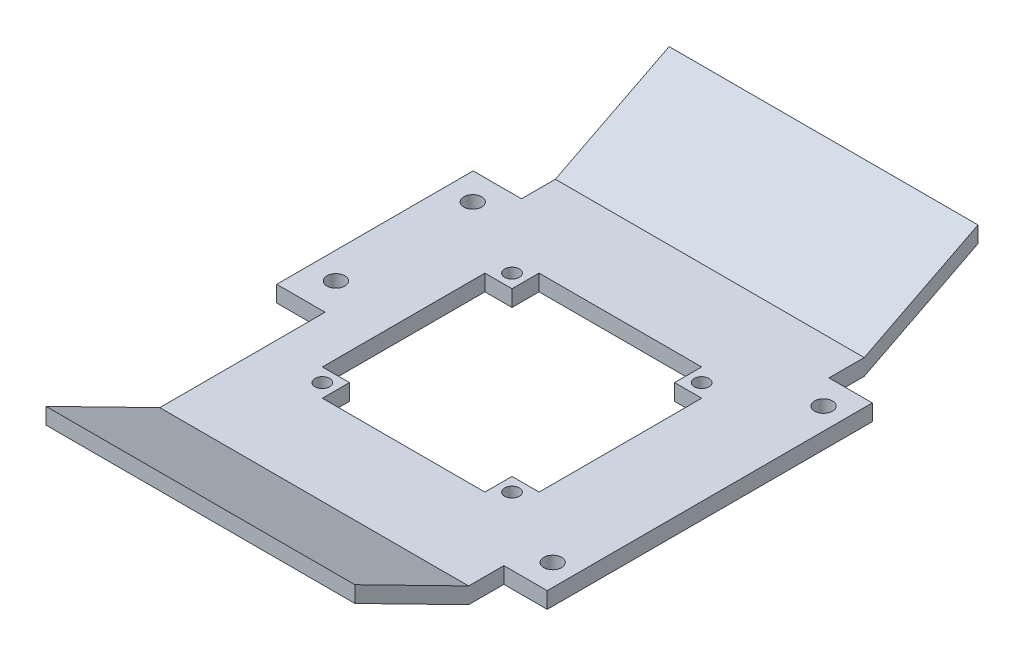
ISO-10303-21;
HEADER;
FILE_DESCRIPTION(('STEP AP214'),'2;1');
FILE_NAME('part.step','',(''),(''),'','','');
FILE_SCHEMA(('AUTOMOTIVE_DESIGN { 1 0 10303 214 1 1 1 1 }'));
ENDSEC;
DATA;
#1=APPLICATION_CONTEXT('core data for automotive mechanical design processes');
#2=APPLICATION_PROTOCOL_DEFINITION('international standard','automotive_design',2000,#1);
#3=PRODUCT_CONTEXT('',#1,'mechanical');
#4=PRODUCT('Part','Part','',(#3));
#5=PRODUCT_RELATED_PRODUCT_CATEGORY('part','',(#4));
#6=PRODUCT_DEFINITION_FORMATION('','',#4);
#7=PRODUCT_DEFINITION_CONTEXT('part definition',#1,'design');
#8=PRODUCT_DEFINITION('design','',#6,#7);
#9=PRODUCT_DEFINITION_SHAPE('','',#8);
#10=(LENGTH_UNIT() NAMED_UNIT(*) SI_UNIT(.MILLI.,.METRE.));
#11=(NAMED_UNIT(*) PLANE_ANGLE_UNIT() SI_UNIT($,.RADIAN.));
#12=(NAMED_UNIT(*) SI_UNIT($,.STERADIAN.) SOLID_ANGLE_UNIT());
#13=UNCERTAINTY_MEASURE_WITH_UNIT(LENGTH_MEASURE(1.E-05),#10,'distance_accuracy_value','');
#14=(GEOMETRIC_REPRESENTATION_CONTEXT(3) GLOBAL_UNCERTAINTY_ASSIGNED_CONTEXT((#13)) GLOBAL_UNIT_ASSIGNED_CONTEXT((#10,
#11,#12)) REPRESENTATION_CONTEXT('',''));
#15=CARTESIAN_POINT('',(0.,0.,0.));
#16=DIRECTION('',(0.,0.,1.));
#17=DIRECTION('',(1.,0.,0.));
#18=AXIS2_PLACEMENT_3D('',#15,#16,#17);
#19=CARTESIAN_POINT('',(28.5,0.,0.));
#20=DIRECTION('',(1.,0.,0.));
#21=DIRECTION('',(0.,0.,-1.));
#22=AXIS2_PLACEMENT_3D('',#19,#20,#21);
#23=PLANE('',#22);
#24=DIRECTION('',(0.,0.,1.));
#25=VECTOR('',#24,1.);
#26=CARTESIAN_POINT('',(28.5,2.99999999999999,-36.5));
#27=LINE('',#26,#25);
#28=CARTESIAN_POINT('',(28.5,2.99999999999999,-36.5));
#29=VERTEX_POINT('',#28);
#30=CARTESIAN_POINT('',(28.5,3.,-30.));
#31=VERTEX_POINT('',#30);
#32=EDGE_CURVE('E255',#29,#31,#27,.T.);
#33=ORIENTED_EDGE('',*,*,#32,.T.);
#34=DIRECTION('',(0.,-1.,0.));
#35=VECTOR('',#34,1.);
#36=CARTESIAN_POINT('',(28.5,3.,-30.));
#37=LINE('',#36,#35);
#38=CARTESIAN_POINT('',(28.5,0.,-30.));
#39=VERTEX_POINT('',#38);
#40=EDGE_CURVE('E378',#31,#39,#37,.T.);
#41=ORIENTED_EDGE('',*,*,#40,.T.);
#42=DIRECTION('',(0.,0.,-1.));
#43=VECTOR('',#42,1.);
#44=CARTESIAN_POINT('',(28.5,0.,36.5));
#45=LINE('',#44,#43);
#46=CARTESIAN_POINT('',(28.5,0.,-36.5));
#47=VERTEX_POINT('',#46);
#48=EDGE_CURVE('E491',#39,#47,#45,.T.);
#49=ORIENTED_EDGE('',*,*,#48,.T.);
#50=DIRECTION('',(0.,0.453990499739541,-0.891006524188371));
#51=VECTOR('',#50,1.);
#52=CARTESIAN_POINT('',(28.5,10.7000344393829,-57.5));
#53=LINE('',#52,#51);
#54=CARTESIAN_POINT('',(28.5,10.7000344393829,-57.5));
#55=VERTEX_POINT('',#54);
#56=EDGE_CURVE('E493',#47,#55,#53,.T.);
#57=ORIENTED_EDGE('',*,*,#56,.T.);
#58=DIRECTION('',(0.,1.,0.));
#59=VECTOR('',#58,1.);
#60=CARTESIAN_POINT('',(28.5,13.7000344393829,-57.5));
#61=LINE('',#60,#59);
#62=CARTESIAN_POINT('',(28.5,13.7000344393829,-57.5));
#63=VERTEX_POINT('',#62);
#64=EDGE_CURVE('E260',#55,#63,#61,.T.);
#65=ORIENTED_EDGE('',*,*,#64,.T.);
#66=DIRECTION('',(0.,-0.453990499739542,0.89100652418837));
#67=VECTOR('',#66,1.);
#68=CARTESIAN_POINT('',(28.5,2.99999999999999,-36.5));
#69=LINE('',#68,#67);
#70=EDGE_CURVE('E256',#63,#29,#69,.T.);
#71=ORIENTED_EDGE('',*,*,#70,.T.);
#72=EDGE_LOOP('',(#33,#41,#49,#57,#65,#71));
#73=FACE_BOUND('',#72,.T.);
#74=ADVANCED_FACE('F39',(#73),#23,.T.);
#75=CARTESIAN_POINT('',(-28.5,0.,0.));
#76=DIRECTION('',(1.,0.,0.));
#77=DIRECTION('',(0.,0.,-1.));
#78=AXIS2_PLACEMENT_3D('',#75,#76,#77);
#79=PLANE('',#78);
#80=DIRECTION('',(0.,-1.,0.));
#81=VECTOR('',#80,1.);
#82=CARTESIAN_POINT('',(-28.5,3.,-30.2513876574721));
#83=LINE('',#82,#81);
#84=CARTESIAN_POINT('',(-28.5,3.,-30.2513876574721));
#85=VERTEX_POINT('',#84);
#86=CARTESIAN_POINT('',(-28.5,0.,-30.2513876574721));
#87=VERTEX_POINT('',#86);
#88=EDGE_CURVE('E412',#85,#87,#83,.T.);
#89=ORIENTED_EDGE('',*,*,#88,.F.);
#90=DIRECTION('',(0.,0.,1.));
#91=VECTOR('',#90,1.);
#92=CARTESIAN_POINT('',(-28.5,2.99999999999999,-36.5));
#93=LINE('',#92,#91);
#94=CARTESIAN_POINT('',(-28.5,2.99999999999999,-36.5));
#95=VERTEX_POINT('',#94);
#96=EDGE_CURVE('E282',#95,#85,#93,.T.);
#97=ORIENTED_EDGE('',*,*,#96,.F.);
#98=DIRECTION('',(0.,-0.453990499739542,0.89100652418837));
#99=VECTOR('',#98,1.);
#100=CARTESIAN_POINT('',(-28.5,2.99999999999999,-36.5));
#101=LINE('',#100,#99);
#102=CARTESIAN_POINT('',(-28.5,13.7000344393829,-57.5));
#103=VERTEX_POINT('',#102);
#104=EDGE_CURVE('E279',#103,#95,#101,.T.);
#105=ORIENTED_EDGE('',*,*,#104,.F.);
#106=DIRECTION('',(0.,1.,0.));
#107=VECTOR('',#106,1.);
#108=CARTESIAN_POINT('',(-28.5,13.7000344393829,-57.5));
#109=LINE('',#108,#107);
#110=CARTESIAN_POINT('',(-28.5,10.7000344393829,-57.5));
#111=VERTEX_POINT('',#110);
#112=EDGE_CURVE('E277',#111,#103,#109,.T.);
#113=ORIENTED_EDGE('',*,*,#112,.F.);
#114=DIRECTION('',(0.,0.453990499739541,-0.891006524188371));
#115=VECTOR('',#114,1.);
#116=CARTESIAN_POINT('',(-28.5,10.7000344393829,-57.5));
#117=LINE('',#116,#115);
#118=CARTESIAN_POINT('',(-28.5,0.,-36.5));
#119=VERTEX_POINT('',#118);
#120=EDGE_CURVE('E275',#119,#111,#117,.T.);
#121=ORIENTED_EDGE('',*,*,#120,.F.);
#122=DIRECTION('',(0.,0.,-1.));
#123=VECTOR('',#122,1.);
#124=CARTESIAN_POINT('',(-28.5,0.,36.5));
#125=LINE('',#124,#123);
#126=EDGE_CURVE('E271',#87,#119,#125,.T.);
#127=ORIENTED_EDGE('',*,*,#126,.F.);
#128=EDGE_LOOP('',(#89,#97,#105,#113,#121,#127));
#129=FACE_BOUND('',#128,.T.);
#130=ADVANCED_FACE('F521',(#129),#79,.F.);
#131=CARTESIAN_POINT('',(28.5,0.,36.5));
#132=DIRECTION('',(0.,1.,0.));
#133=DIRECTION('',(0.,0.,1.));
#134=AXIS2_PLACEMENT_3D('',#131,#132,#133);
#135=PLANE('',#134);
#136=CARTESIAN_POINT('',(-28.5,0.,36.5));
#137=VERTEX_POINT('',#136);
#138=CARTESIAN_POINT('',(-28.5,0.,6.));
#139=VERTEX_POINT('',#138);
#140=EDGE_CURVE('E272',#137,#139,#125,.T.);
#141=ORIENTED_EDGE('',*,*,#140,.T.);
#142=DIRECTION('',(1.,0.,0.));
#143=VECTOR('',#142,1.);
#144=CARTESIAN_POINT('',(-37.4223871305394,0.,6.));
#145=LINE('',#144,#143);
#146=CARTESIAN_POINT('',(-37.4223871305394,0.,6.));
#147=VERTEX_POINT('',#146);
#148=EDGE_CURVE('E64',#147,#139,#145,.T.);
#149=ORIENTED_EDGE('',*,*,#148,.F.);
#150=DIRECTION('',(0.,0.,1.));
#151=VECTOR('',#150,1.);
#152=CARTESIAN_POINT('',(-37.4223871305394,0.,-30.2513876574721));
#153=LINE('',#152,#151);
#154=CARTESIAN_POINT('',(-37.4223871305394,0.,-30.2513876574721));
#155=VERTEX_POINT('',#154);
#156=EDGE_CURVE('E403',#155,#147,#153,.T.);
#157=ORIENTED_EDGE('',*,*,#156,.F.);
#158=DIRECTION('',(-1.,0.,0.));
#159=VECTOR('',#158,1.);
#160=CARTESIAN_POINT('',(-28.5,0.,-30.2513876574721));
#161=LINE('',#160,#159);
#162=EDGE_CURVE('E392',#87,#155,#161,.T.);
#163=ORIENTED_EDGE('',*,*,#162,.F.);
#164=ORIENTED_EDGE('',*,*,#126,.T.);
#165=DIRECTION('',(-1.,0.,0.));
#166=VECTOR('',#165,1.);
#167=CARTESIAN_POINT('',(28.5,0.,-36.5));
#168=LINE('',#167,#166);
#169=EDGE_CURVE('E299',#47,#119,#168,.T.);
#170=ORIENTED_EDGE('',*,*,#169,.F.);
#171=ORIENTED_EDGE('',*,*,#48,.F.);
#172=DIRECTION('',(-1.,0.,0.));
#173=VECTOR('',#172,1.);
#174=CARTESIAN_POINT('',(28.5,0.,-30.));
#175=LINE('',#174,#173);
#176=CARTESIAN_POINT('',(36.5,0.,-30.));
#177=VERTEX_POINT('',#176);
#178=EDGE_CURVE('E56',#177,#39,#175,.T.);
#179=ORIENTED_EDGE('',*,*,#178,.F.);
#180=DIRECTION('',(0.,0.,-1.));
#181=VECTOR('',#180,1.);
#182=CARTESIAN_POINT('',(36.5,0.,-30.));
#183=LINE('',#182,#181);
#184=CARTESIAN_POINT('',(36.5,0.,30.));
#185=VERTEX_POINT('',#184);
#186=EDGE_CURVE('E380',#185,#177,#183,.T.);
#187=ORIENTED_EDGE('',*,*,#186,.F.);
#188=DIRECTION('',(1.,0.,0.));
#189=VECTOR('',#188,1.);
#190=CARTESIAN_POINT('',(28.5,0.,30.));
#191=LINE('',#190,#189);
#192=CARTESIAN_POINT('',(28.5,0.,30.));
#193=VERTEX_POINT('',#192);
#194=EDGE_CURVE('E373',#193,#185,#191,.T.);
#195=ORIENTED_EDGE('',*,*,#194,.F.);
#196=CARTESIAN_POINT('',(28.5,0.,36.5));
#197=VERTEX_POINT('',#196);
#198=EDGE_CURVE('E246',#197,#193,#45,.T.);
#199=ORIENTED_EDGE('',*,*,#198,.F.);
#200=DIRECTION('',(-1.,0.,0.));
#201=VECTOR('',#200,1.);
#202=CARTESIAN_POINT('',(28.5,0.,36.5));
#203=LINE('',#202,#201);
#204=EDGE_CURVE('E302',#197,#137,#203,.T.);
#205=ORIENTED_EDGE('',*,*,#204,.T.);
#206=EDGE_LOOP('',(#141,#149,#157,#163,#164,#170,#171,#179,#187,#195,#199,#205));
#207=FACE_BOUND('',#206,.T.);
#208=DIRECTION('',(0.,0.,1.));
#209=VECTOR('',#208,1.);
#210=CARTESIAN_POINT('',(-15.,0.,-15.));
#211=LINE('',#210,#209);
#212=CARTESIAN_POINT('',(-15.,0.,-20.));
#213=VERTEX_POINT('',#212);
#214=CARTESIAN_POINT('',(-15.,0.,-15.));
#215=VERTEX_POINT('',#214);
#216=EDGE_CURVE('E419',#213,#215,#211,.T.);
#217=ORIENTED_EDGE('',*,*,#216,.T.);
#218=DIRECTION('',(-1.,0.,0.));
#219=VECTOR('',#218,1.);
#220=CARTESIAN_POINT('',(-20.,0.,-15.));
#221=LINE('',#220,#219);
#222=CARTESIAN_POINT('',(-20.,0.,-15.));
#223=VERTEX_POINT('',#222);
#224=EDGE_CURVE('E430',#215,#223,#221,.T.);
#225=ORIENTED_EDGE('',*,*,#224,.T.);
#226=DIRECTION('',(0.,0.,1.));
#227=VECTOR('',#226,1.);
#228=CARTESIAN_POINT('',(-20.,0.,15.));
#229=LINE('',#228,#227);
#230=CARTESIAN_POINT('',(-20.,0.,15.));
#231=VERTEX_POINT('',#230);
#232=EDGE_CURVE('E433',#223,#231,#229,.T.);
#233=ORIENTED_EDGE('',*,*,#232,.T.);
#234=DIRECTION('',(1.,0.,0.));
#235=VECTOR('',#234,1.);
#236=CARTESIAN_POINT('',(-15.,0.,15.));
#237=LINE('',#236,#235);
#238=CARTESIAN_POINT('',(-15.,0.,15.));
#239=VERTEX_POINT('',#238);
#240=EDGE_CURVE('E436',#231,#239,#237,.T.);
#241=ORIENTED_EDGE('',*,*,#240,.T.);
#242=DIRECTION('',(0.,0.,1.));
#243=VECTOR('',#242,1.);
#244=CARTESIAN_POINT('',(-15.,0.,20.));
#245=LINE('',#244,#243);
#246=CARTESIAN_POINT('',(-15.,0.,20.));
#247=VERTEX_POINT('',#246);
#248=EDGE_CURVE('E439',#239,#247,#245,.T.);
#249=ORIENTED_EDGE('',*,*,#248,.T.);
#250=DIRECTION('',(1.,0.,0.));
#251=VECTOR('',#250,1.);
#252=CARTESIAN_POINT('',(15.,0.,20.));
#253=LINE('',#252,#251);
#254=CARTESIAN_POINT('',(15.,0.,20.));
#255=VERTEX_POINT('',#254);
#256=EDGE_CURVE('E442',#247,#255,#253,.T.);
#257=ORIENTED_EDGE('',*,*,#256,.T.);
#258=DIRECTION('',(0.,0.,-1.));
#259=VECTOR('',#258,1.);
#260=CARTESIAN_POINT('',(15.,0.,15.));
#261=LINE('',#260,#259);
#262=CARTESIAN_POINT('',(15.,0.,15.));
#263=VERTEX_POINT('',#262);
#264=EDGE_CURVE('E445',#255,#263,#261,.T.);
#265=ORIENTED_EDGE('',*,*,#264,.T.);
#266=DIRECTION('',(1.,0.,0.));
#267=VECTOR('',#266,1.);
#268=CARTESIAN_POINT('',(20.,0.,15.));
#269=LINE('',#268,#267);
#270=CARTESIAN_POINT('',(20.,0.,15.));
#271=VERTEX_POINT('',#270);
#272=EDGE_CURVE('E448',#263,#271,#269,.T.);
#273=ORIENTED_EDGE('',*,*,#272,.T.);
#274=DIRECTION('',(0.,0.,-1.));
#275=VECTOR('',#274,1.);
#276=CARTESIAN_POINT('',(20.,0.,-15.));
#277=LINE('',#276,#275);
#278=CARTESIAN_POINT('',(20.,0.,-15.));
#279=VERTEX_POINT('',#278);
#280=EDGE_CURVE('E451',#271,#279,#277,.T.);
#281=ORIENTED_EDGE('',*,*,#280,.T.);
#282=DIRECTION('',(-1.,0.,0.));
#283=VECTOR('',#282,1.);
#284=CARTESIAN_POINT('',(15.,0.,-15.));
#285=LINE('',#284,#283);
#286=CARTESIAN_POINT('',(15.,0.,-15.));
#287=VERTEX_POINT('',#286);
#288=EDGE_CURVE('E454',#279,#287,#285,.T.);
#289=ORIENTED_EDGE('',*,*,#288,.T.);
#290=DIRECTION('',(0.,0.,-1.));
#291=VECTOR('',#290,1.);
#292=CARTESIAN_POINT('',(15.,0.,-20.));
#293=LINE('',#292,#291);
#294=CARTESIAN_POINT('',(15.,0.,-20.));
#295=VERTEX_POINT('',#294);
#296=EDGE_CURVE('E457',#287,#295,#293,.T.);
#297=ORIENTED_EDGE('',*,*,#296,.T.);
#298=DIRECTION('',(-1.,0.,0.));
#299=VECTOR('',#298,1.);
#300=CARTESIAN_POINT('',(-15.,0.,-20.));
#301=LINE('',#300,#299);
#302=EDGE_CURVE('E460',#295,#213,#301,.T.);
#303=ORIENTED_EDGE('',*,*,#302,.T.);
#304=EDGE_LOOP('',(#217,#225,#233,#241,#249,#257,#265,#273,#281,#289,#297,#303));
#305=FACE_BOUND('',#304,.T.);
#306=CARTESIAN_POINT('',(-17.5,0.,-17.5));
#307=DIRECTION('',(0.,1.,0.));
#308=DIRECTION('',(0.,0.,1.));
#309=AXIS2_PLACEMENT_3D('',#306,#307,#308);
#310=CIRCLE('',#309,1.35);
#311=CARTESIAN_POINT('',(-17.5,0.,-16.15));
#312=VERTEX_POINT('',#311);
#313=EDGE_CURVE('E416',#312,#312,#310,.T.);
#314=ORIENTED_EDGE('',*,*,#313,.T.);
#315=EDGE_LOOP('',(#314));
#316=FACE_BOUND('',#315,.T.);
#317=CARTESIAN_POINT('',(17.5,0.,-17.500000000001));
#318=DIRECTION('',(0.,1.,0.));
#319=DIRECTION('',(0.,0.,1.));
#320=AXIS2_PLACEMENT_3D('',#317,#318,#319);
#321=CIRCLE('',#320,1.35000000000102);
#322=CARTESIAN_POINT('',(17.5,0.,-16.15));
#323=VERTEX_POINT('',#322);
#324=EDGE_CURVE('E420',#323,#323,#321,.T.);
#325=ORIENTED_EDGE('',*,*,#324,.T.);
#326=EDGE_LOOP('',(#325));
#327=FACE_BOUND('',#326,.T.);
#328=CARTESIAN_POINT('',(17.500000000001,0.,17.499999999999));
#329=DIRECTION('',(0.,1.,0.));
#330=DIRECTION('',(0.,0.,1.));
#331=AXIS2_PLACEMENT_3D('',#328,#329,#330);
#332=CIRCLE('',#331,1.35000000000138);
#333=CARTESIAN_POINT('',(17.500000000001,0.,18.8500000000004));
#334=VERTEX_POINT('',#333);
#335=EDGE_CURVE('E423',#334,#334,#332,.T.);
#336=ORIENTED_EDGE('',*,*,#335,.T.);
#337=EDGE_LOOP('',(#336));
#338=FACE_BOUND('',#337,.T.);
#339=CARTESIAN_POINT('',(-17.499999999999,0.,17.5));
#340=DIRECTION('',(0.,1.,0.));
#341=DIRECTION('',(0.,0.,1.));
#342=AXIS2_PLACEMENT_3D('',#339,#340,#341);
#343=CIRCLE('',#342,1.35000000000052);
#344=CARTESIAN_POINT('',(-17.499999999999,0.,18.8500000000005));
#345=VERTEX_POINT('',#344);
#346=EDGE_CURVE('E415',#345,#345,#343,.T.);
#347=ORIENTED_EDGE('',*,*,#346,.T.);
#348=EDGE_LOOP('',(#347));
#349=FACE_BOUND('',#348,.T.);
#350=CARTESIAN_POINT('',(-32.5,0.,0.));
#351=DIRECTION('',(0.,1.,0.));
#352=DIRECTION('',(0.,0.,1.));
#353=AXIS2_PLACEMENT_3D('',#350,#351,#352);
#354=CIRCLE('',#353,1.65);
#355=CARTESIAN_POINT('',(-32.5,0.,1.65));
#356=VERTEX_POINT('',#355);
#357=EDGE_CURVE('E388',#356,#356,#354,.T.);
#358=ORIENTED_EDGE('',*,*,#357,.T.);
#359=EDGE_LOOP('',(#358));
#360=FACE_BOUND('',#359,.T.);
#361=CARTESIAN_POINT('',(-32.5,0.,-25.2513876574721));
#362=DIRECTION('',(0.,1.,0.));
#363=DIRECTION('',(0.,0.,1.));
#364=AXIS2_PLACEMENT_3D('',#361,#362,#363);
#365=CIRCLE('',#364,1.65);
#366=CARTESIAN_POINT('',(-32.5,0.,-23.6013876574721));
#367=VERTEX_POINT('',#366);
#368=EDGE_CURVE('E247',#367,#367,#365,.T.);
#369=ORIENTED_EDGE('',*,*,#368,.T.);
#370=EDGE_LOOP('',(#369));
#371=FACE_BOUND('',#370,.T.);
#372=CARTESIAN_POINT('',(32.5,0.,25.));
#373=DIRECTION('',(0.,1.,0.));
#374=DIRECTION('',(0.,0.,1.));
#375=AXIS2_PLACEMENT_3D('',#372,#373,#374);
#376=CIRCLE('',#375,1.65);
#377=CARTESIAN_POINT('',(32.5,0.,26.65));
#378=VERTEX_POINT('',#377);
#379=EDGE_CURVE('E365',#378,#378,#376,.T.);
#380=ORIENTED_EDGE('',*,*,#379,.T.);
#381=EDGE_LOOP('',(#380));
#382=FACE_BOUND('',#381,.T.);
#383=CARTESIAN_POINT('',(32.5,0.,-25.));
#384=DIRECTION('',(0.,1.,0.));
#385=DIRECTION('',(0.,0.,1.));
#386=AXIS2_PLACEMENT_3D('',#383,#384,#385);
#387=CIRCLE('',#386,1.65);
#388=CARTESIAN_POINT('',(32.5,0.,-23.35));
#389=VERTEX_POINT('',#388);
#390=EDGE_CURVE('E366',#389,#389,#387,.T.);
#391=ORIENTED_EDGE('',*,*,#390,.T.);
#392=EDGE_LOOP('',(#391));
#393=FACE_BOUND('',#392,.T.);
#394=ADVANCED_FACE('F347',(#207,#305,#316,#327,#338,#349,#360,#371,#382,#393),#135,.F.);
#395=CARTESIAN_POINT('',(28.5,2.99999999999999,-36.5));
#396=DIRECTION('',(0.,-1.,0.));
#397=DIRECTION('',(0.,0.,-1.));
#398=AXIS2_PLACEMENT_3D('',#395,#396,#397);
#399=PLANE('',#398);
#400=ORIENTED_EDGE('',*,*,#96,.T.);
#401=DIRECTION('',(-1.,0.,0.));
#402=VECTOR('',#401,1.);
#403=CARTESIAN_POINT('',(-28.5,3.,-30.2513876574721));
#404=LINE('',#403,#402);
#405=CARTESIAN_POINT('',(-37.4223871305394,3.,-30.2513876574721));
#406=VERTEX_POINT('',#405);
#407=EDGE_CURVE('E395',#85,#406,#404,.T.);
#408=ORIENTED_EDGE('',*,*,#407,.T.);
#409=DIRECTION('',(0.,0.,1.));
#410=VECTOR('',#409,1.);
#411=CARTESIAN_POINT('',(-37.4223871305394,3.,-30.2513876574721));
#412=LINE('',#411,#410);
#413=CARTESIAN_POINT('',(-37.4223871305394,3.,6.));
#414=VERTEX_POINT('',#413);
#415=EDGE_CURVE('E397',#406,#414,#412,.T.);
#416=ORIENTED_EDGE('',*,*,#415,.T.);
#417=DIRECTION('',(1.,0.,0.));
#418=VECTOR('',#417,1.);
#419=CARTESIAN_POINT('',(-37.4223871305394,3.,6.));
#420=LINE('',#419,#418);
#421=CARTESIAN_POINT('',(-28.5,3.,6.));
#422=VERTEX_POINT('',#421);
#423=EDGE_CURVE('E399',#414,#422,#420,.T.);
#424=ORIENTED_EDGE('',*,*,#423,.T.);
#425=CARTESIAN_POINT('',(-28.5,2.99999999999999,36.5));
#426=VERTEX_POINT('',#425);
#427=EDGE_CURVE('E281',#422,#426,#93,.T.);
#428=ORIENTED_EDGE('',*,*,#427,.T.);
#429=DIRECTION('',(-1.,0.,0.));
#430=VECTOR('',#429,1.);
#431=CARTESIAN_POINT('',(28.5,2.99999999999999,36.5));
#432=LINE('',#431,#430);
#433=CARTESIAN_POINT('',(28.5,2.99999999999999,36.5));
#434=VERTEX_POINT('',#433);
#435=EDGE_CURVE('E253',#434,#426,#432,.T.);
#436=ORIENTED_EDGE('',*,*,#435,.F.);
#437=CARTESIAN_POINT('',(28.5,3.,30.));
#438=VERTEX_POINT('',#437);
#439=EDGE_CURVE('E243',#438,#434,#27,.T.);
#440=ORIENTED_EDGE('',*,*,#439,.F.);
#441=DIRECTION('',(1.,0.,0.));
#442=VECTOR('',#441,1.);
#443=CARTESIAN_POINT('',(28.5,3.,30.));
#444=LINE('',#443,#442);
#445=CARTESIAN_POINT('',(36.5,3.,30.));
#446=VERTEX_POINT('',#445);
#447=EDGE_CURVE('E229',#438,#446,#444,.T.);
#448=ORIENTED_EDGE('',*,*,#447,.T.);
#449=DIRECTION('',(0.,0.,-1.));
#450=VECTOR('',#449,1.);
#451=CARTESIAN_POINT('',(36.5,3.,-30.));
#452=LINE('',#451,#450);
#453=CARTESIAN_POINT('',(36.5,3.,-30.));
#454=VERTEX_POINT('',#453);
#455=EDGE_CURVE('E239',#446,#454,#452,.T.);
#456=ORIENTED_EDGE('',*,*,#455,.T.);
#457=DIRECTION('',(-1.,0.,0.));
#458=VECTOR('',#457,1.);
#459=CARTESIAN_POINT('',(28.5,3.,-30.));
#460=LINE('',#459,#458);
#461=EDGE_CURVE('E376',#454,#31,#460,.T.);
#462=ORIENTED_EDGE('',*,*,#461,.T.);
#463=ORIENTED_EDGE('',*,*,#32,.F.);
#464=DIRECTION('',(-1.,0.,0.));
#465=VECTOR('',#464,1.);
#466=CARTESIAN_POINT('',(28.5,2.99999999999999,-36.5));
#467=LINE('',#466,#465);
#468=EDGE_CURVE('E290',#29,#95,#467,.T.);
#469=ORIENTED_EDGE('',*,*,#468,.T.);
#470=EDGE_LOOP('',(#400,#408,#416,#424,#428,#436,#440,#448,#456,#462,#463,#469));
#471=FACE_BOUND('',#470,.T.);
#472=DIRECTION('',(0.,0.,1.));
#473=VECTOR('',#472,1.);
#474=CARTESIAN_POINT('',(-15.,2.99999999999999,-36.5));
#475=LINE('',#474,#473);
#476=CARTESIAN_POINT('',(-15.,3.,-20.));
#477=VERTEX_POINT('',#476);
#478=CARTESIAN_POINT('',(-15.,3.,-15.));
#479=VERTEX_POINT('',#478);
#480=EDGE_CURVE('E11',#477,#479,#475,.T.);
#481=ORIENTED_EDGE('',*,*,#480,.F.);
#482=DIRECTION('',(-1.,0.,0.));
#483=VECTOR('',#482,1.);
#484=CARTESIAN_POINT('',(28.5,2.99999999999999,-20.));
#485=LINE('',#484,#483);
#486=CARTESIAN_POINT('',(15.,2.99999999999999,-20.));
#487=VERTEX_POINT('',#486);
#488=EDGE_CURVE('E308',#487,#477,#485,.T.);
#489=ORIENTED_EDGE('',*,*,#488,.F.);
#490=DIRECTION('',(0.,0.,-1.));
#491=VECTOR('',#490,1.);
#492=CARTESIAN_POINT('',(15.,2.99999999999999,-36.5));
#493=LINE('',#492,#491);
#494=CARTESIAN_POINT('',(15.,3.,-15.));
#495=VERTEX_POINT('',#494);
#496=EDGE_CURVE('E310',#495,#487,#493,.T.);
#497=ORIENTED_EDGE('',*,*,#496,.F.);
#498=DIRECTION('',(-1.,0.,0.));
#499=VECTOR('',#498,1.);
#500=CARTESIAN_POINT('',(28.5,2.99999999999999,-15.));
#501=LINE('',#500,#499);
#502=CARTESIAN_POINT('',(20.,3.,-15.));
#503=VERTEX_POINT('',#502);
#504=EDGE_CURVE('E313',#503,#495,#501,.T.);
#505=ORIENTED_EDGE('',*,*,#504,.F.);
#506=DIRECTION('',(0.,0.,-1.));
#507=VECTOR('',#506,1.);
#508=CARTESIAN_POINT('',(20.,2.99999999999999,-36.5));
#509=LINE('',#508,#507);
#510=CARTESIAN_POINT('',(20.,3.,15.));
#511=VERTEX_POINT('',#510);
#512=EDGE_CURVE('E315',#511,#503,#509,.T.);
#513=ORIENTED_EDGE('',*,*,#512,.F.);
#514=DIRECTION('',(1.,0.,0.));
#515=VECTOR('',#514,1.);
#516=CARTESIAN_POINT('',(28.5,2.99999999999999,15.));
#517=LINE('',#516,#515);
#518=CARTESIAN_POINT('',(15.,3.,15.));
#519=VERTEX_POINT('',#518);
#520=EDGE_CURVE('E317',#519,#511,#517,.T.);
#521=ORIENTED_EDGE('',*,*,#520,.F.);
#522=DIRECTION('',(0.,0.,-1.));
#523=VECTOR('',#522,1.);
#524=CARTESIAN_POINT('',(15.,2.99999999999999,-36.5));
#525=LINE('',#524,#523);
#526=CARTESIAN_POINT('',(15.,3.,20.));
#527=VERTEX_POINT('',#526);
#528=EDGE_CURVE('E319',#527,#519,#525,.T.);
#529=ORIENTED_EDGE('',*,*,#528,.F.);
#530=DIRECTION('',(1.,0.,0.));
#531=VECTOR('',#530,1.);
#532=CARTESIAN_POINT('',(28.5,2.99999999999999,20.));
#533=LINE('',#532,#531);
#534=CARTESIAN_POINT('',(-15.,3.,20.));
#535=VERTEX_POINT('',#534);
#536=EDGE_CURVE('E321',#535,#527,#533,.T.);
#537=ORIENTED_EDGE('',*,*,#536,.F.);
#538=DIRECTION('',(0.,0.,1.));
#539=VECTOR('',#538,1.);
#540=CARTESIAN_POINT('',(-15.,2.99999999999999,-36.5));
#541=LINE('',#540,#539);
#542=CARTESIAN_POINT('',(-15.,3.,15.));
#543=VERTEX_POINT('',#542);
#544=EDGE_CURVE('E323',#543,#535,#541,.T.);
#545=ORIENTED_EDGE('',*,*,#544,.F.);
#546=DIRECTION('',(1.,0.,0.));
#547=VECTOR('',#546,1.);
#548=CARTESIAN_POINT('',(28.5,2.99999999999999,15.));
#549=LINE('',#548,#547);
#550=CARTESIAN_POINT('',(-20.,3.,15.));
#551=VERTEX_POINT('',#550);
#552=EDGE_CURVE('E325',#551,#543,#549,.T.);
#553=ORIENTED_EDGE('',*,*,#552,.F.);
#554=DIRECTION('',(0.,0.,1.));
#555=VECTOR('',#554,1.);
#556=CARTESIAN_POINT('',(-20.,2.99999999999999,-36.5));
#557=LINE('',#556,#555);
#558=CARTESIAN_POINT('',(-20.,3.,-15.));
#559=VERTEX_POINT('',#558);
#560=EDGE_CURVE('E327',#559,#551,#557,.T.);
#561=ORIENTED_EDGE('',*,*,#560,.F.);
#562=DIRECTION('',(-1.,0.,0.));
#563=VECTOR('',#562,1.);
#564=CARTESIAN_POINT('',(28.5,2.99999999999999,-15.));
#565=LINE('',#564,#563);
#566=EDGE_CURVE('E48',#479,#559,#565,.T.);
#567=ORIENTED_EDGE('',*,*,#566,.F.);
#568=EDGE_LOOP('',(#481,#489,#497,#505,#513,#521,#529,#537,#545,#553,#561,#567));
#569=FACE_BOUND('',#568,.T.);
#570=CARTESIAN_POINT('',(-17.5,2.99999999999999,-17.5));
#571=DIRECTION('',(0.,-1.,0.));
#572=DIRECTION('',(0.,0.,-1.));
#573=AXIS2_PLACEMENT_3D('',#570,#571,#572);
#574=CIRCLE('',#573,1.35);
#575=CARTESIAN_POINT('',(-17.5,2.99999999999999,-18.85));
#576=VERTEX_POINT('',#575);
#577=EDGE_CURVE('E330',#576,#576,#574,.F.);
#578=ORIENTED_EDGE('',*,*,#577,.F.);
#579=EDGE_LOOP('',(#578));
#580=FACE_BOUND('',#579,.T.);
#581=CARTESIAN_POINT('',(17.5,2.99999999999999,-17.500000000001));
#582=DIRECTION('',(0.,-1.,0.));
#583=DIRECTION('',(0.,0.,-1.));
#584=AXIS2_PLACEMENT_3D('',#581,#582,#583);
#585=CIRCLE('',#584,1.35000000000102);
#586=CARTESIAN_POINT('',(17.5,2.99999999999999,-18.850000000002));
#587=VERTEX_POINT('',#586);
#588=EDGE_CURVE('E333',#587,#587,#585,.F.);
#589=ORIENTED_EDGE('',*,*,#588,.F.);
#590=EDGE_LOOP('',(#589));
#591=FACE_BOUND('',#590,.T.);
#592=CARTESIAN_POINT('',(17.500000000001,2.99999999999999,17.499999999999));
#593=DIRECTION('',(0.,-1.,0.));
#594=DIRECTION('',(0.,0.,-1.));
#595=AXIS2_PLACEMENT_3D('',#592,#593,#594);
#596=CIRCLE('',#595,1.35000000000138);
#597=CARTESIAN_POINT('',(17.500000000001,2.99999999999999,16.1499999999976));
#598=VERTEX_POINT('',#597);
#599=EDGE_CURVE('E336',#598,#598,#596,.F.);
#600=ORIENTED_EDGE('',*,*,#599,.F.);
#601=EDGE_LOOP('',(#600));
#602=FACE_BOUND('',#601,.T.);
#603=CARTESIAN_POINT('',(-17.499999999999,2.99999999999999,17.5));
#604=DIRECTION('',(0.,-1.,0.));
#605=DIRECTION('',(0.,0.,-1.));
#606=AXIS2_PLACEMENT_3D('',#603,#604,#605);
#607=CIRCLE('',#606,1.35000000000052);
#608=CARTESIAN_POINT('',(-17.499999999999,2.99999999999999,16.1499999999995));
#609=VERTEX_POINT('',#608);
#610=EDGE_CURVE('E43',#609,#609,#607,.F.);
#611=ORIENTED_EDGE('',*,*,#610,.F.);
#612=EDGE_LOOP('',(#611));
#613=FACE_BOUND('',#612,.T.);
#614=CARTESIAN_POINT('',(-32.5,3.,0.));
#615=DIRECTION('',(0.,1.,0.));
#616=DIRECTION('',(0.,0.,1.));
#617=AXIS2_PLACEMENT_3D('',#614,#615,#616);
#618=CIRCLE('',#617,1.65);
#619=CARTESIAN_POINT('',(-32.5,3.,1.65));
#620=VERTEX_POINT('',#619);
#621=EDGE_CURVE('E352',#620,#620,#618,.T.);
#622=ORIENTED_EDGE('',*,*,#621,.F.);
#623=EDGE_LOOP('',(#622));
#624=FACE_BOUND('',#623,.T.);
#625=CARTESIAN_POINT('',(-32.5,3.,-25.2513876574721));
#626=DIRECTION('',(0.,1.,0.));
#627=DIRECTION('',(0.,0.,1.));
#628=AXIS2_PLACEMENT_3D('',#625,#626,#627);
#629=CIRCLE('',#628,1.65);
#630=CARTESIAN_POINT('',(-32.5,3.,-23.6013876574721));
#631=VERTEX_POINT('',#630);
#632=EDGE_CURVE('E356',#631,#631,#629,.T.);
#633=ORIENTED_EDGE('',*,*,#632,.F.);
#634=EDGE_LOOP('',(#633));
#635=FACE_BOUND('',#634,.T.);
#636=CARTESIAN_POINT('',(32.5,3.,25.));
#637=DIRECTION('',(0.,1.,0.));
#638=DIRECTION('',(0.,0.,1.));
#639=AXIS2_PLACEMENT_3D('',#636,#637,#638);
#640=CIRCLE('',#639,1.65);
#641=CARTESIAN_POINT('',(32.5,3.,26.65));
#642=VERTEX_POINT('',#641);
#643=EDGE_CURVE('E360',#642,#642,#640,.T.);
#644=ORIENTED_EDGE('',*,*,#643,.F.);
#645=EDGE_LOOP('',(#644));
#646=FACE_BOUND('',#645,.T.);
#647=CARTESIAN_POINT('',(32.5,3.,-25.));
#648=DIRECTION('',(0.,1.,0.));
#649=DIRECTION('',(0.,0.,1.));
#650=AXIS2_PLACEMENT_3D('',#647,#648,#649);
#651=CIRCLE('',#650,1.65);
#652=CARTESIAN_POINT('',(32.5,3.,-23.35));
#653=VERTEX_POINT('',#652);
#654=EDGE_CURVE('E363',#653,#653,#651,.T.);
#655=ORIENTED_EDGE('',*,*,#654,.F.);
#656=EDGE_LOOP('',(#655));
#657=FACE_BOUND('',#656,.T.);
#658=ADVANCED_FACE('F250',(#471,#569,#580,#591,#602,#613,#624,#635,#646,#657),#399,.F.);
#659=CARTESIAN_POINT('',(28.5,13.700034439383,57.5));
#660=DIRECTION('',(0.,0.,-1.));
#661=DIRECTION('',(-1.,0.,0.));
#662=AXIS2_PLACEMENT_3D('',#659,#660,#661);
#663=PLANE('',#662);
#664=DIRECTION('',(0.,-1.,0.));
#665=VECTOR('',#664,1.);
#666=CARTESIAN_POINT('',(-28.5,13.700034439383,57.5));
#667=LINE('',#666,#665);
#668=CARTESIAN_POINT('',(-28.5,13.700034439383,57.5));
#669=VERTEX_POINT('',#668);
#670=CARTESIAN_POINT('',(-28.5,10.700034439383,57.5));
#671=VERTEX_POINT('',#670);
#672=EDGE_CURVE('E266',#669,#671,#667,.T.);
#673=ORIENTED_EDGE('',*,*,#672,.T.);
#674=DIRECTION('',(-1.,0.,0.));
#675=VECTOR('',#674,1.);
#676=CARTESIAN_POINT('',(28.5,10.700034439383,57.5));
#677=LINE('',#676,#675);
#678=CARTESIAN_POINT('',(28.5,10.700034439383,57.5));
#679=VERTEX_POINT('',#678);
#680=EDGE_CURVE('E305',#679,#671,#677,.T.);
#681=ORIENTED_EDGE('',*,*,#680,.F.);
#682=DIRECTION('',(0.,-1.,0.));
#683=VECTOR('',#682,1.);
#684=CARTESIAN_POINT('',(28.5,13.700034439383,57.5));
#685=LINE('',#684,#683);
#686=CARTESIAN_POINT('',(28.5,13.700034439383,57.5));
#687=VERTEX_POINT('',#686);
#688=EDGE_CURVE('E286',#687,#679,#685,.T.);
#689=ORIENTED_EDGE('',*,*,#688,.F.);
#690=DIRECTION('',(-1.,0.,0.));
#691=VECTOR('',#690,1.);
#692=CARTESIAN_POINT('',(28.5,13.700034439383,57.5));
#693=LINE('',#692,#691);
#694=EDGE_CURVE('E265',#687,#669,#693,.T.);
#695=ORIENTED_EDGE('',*,*,#694,.T.);
#696=EDGE_LOOP('',(#673,#681,#689,#695));
#697=FACE_BOUND('',#696,.T.);
#698=ADVANCED_FACE('F41',(#697),#663,.F.);
#699=CARTESIAN_POINT('',(28.5,10.700034439383,57.5));
#700=DIRECTION('',(0.,0.891006524188367,-0.453990499739548));
#701=DIRECTION('',(0.,0.453990499739548,0.891006524188367));
#702=AXIS2_PLACEMENT_3D('',#699,#700,#701);
#703=PLANE('',#702);
#704=DIRECTION('',(0.,-0.453990499739548,-0.891006524188367));
#705=VECTOR('',#704,1.);
#706=CARTESIAN_POINT('',(-28.5,10.700034439383,57.5));
#707=LINE('',#706,#705);
#708=EDGE_CURVE('E269',#671,#137,#707,.T.);
#709=ORIENTED_EDGE('',*,*,#708,.T.);
#710=ORIENTED_EDGE('',*,*,#204,.F.);
#711=DIRECTION('',(0.,-0.453990499739548,-0.891006524188367));
#712=VECTOR('',#711,1.);
#713=CARTESIAN_POINT('',(28.5,10.700034439383,57.5));
#714=LINE('',#713,#712);
#715=EDGE_CURVE('E489',#679,#197,#714,.T.);
#716=ORIENTED_EDGE('',*,*,#715,.F.);
#717=ORIENTED_EDGE('',*,*,#680,.T.);
#718=EDGE_LOOP('',(#709,#710,#716,#717));
#719=FACE_BOUND('',#718,.T.);
#720=ADVANCED_FACE('F546',(#719),#703,.F.);
#721=CARTESIAN_POINT('',(28.5,10.7000344393829,-57.5));
#722=DIRECTION('',(0.,0.891006524188371,0.453990499739541));
#723=DIRECTION('',(0.,-0.453990499739541,0.891006524188371));
#724=AXIS2_PLACEMENT_3D('',#721,#722,#723);
#725=PLANE('',#724);
#726=ORIENTED_EDGE('',*,*,#120,.T.);
#727=DIRECTION('',(-1.,0.,0.));
#728=VECTOR('',#727,1.);
#729=CARTESIAN_POINT('',(28.5,10.7000344393829,-57.5));
#730=LINE('',#729,#728);
#731=EDGE_CURVE('E296',#55,#111,#730,.T.);
#732=ORIENTED_EDGE('',*,*,#731,.F.);
#733=ORIENTED_EDGE('',*,*,#56,.F.);
#734=ORIENTED_EDGE('',*,*,#169,.T.);
#735=EDGE_LOOP('',(#726,#732,#733,#734));
#736=FACE_BOUND('',#735,.T.);
#737=ADVANCED_FACE('F518',(#736),#725,.F.);
#738=CARTESIAN_POINT('',(28.5,13.7000344393829,-57.5));
#739=DIRECTION('',(0.,0.,1.));
#740=DIRECTION('',(1.,0.,0.));
#741=AXIS2_PLACEMENT_3D('',#738,#739,#740);
#742=PLANE('',#741);
#743=ORIENTED_EDGE('',*,*,#112,.T.);
#744=DIRECTION('',(-1.,0.,0.));
#745=VECTOR('',#744,1.);
#746=CARTESIAN_POINT('',(28.5,13.7000344393829,-57.5));
#747=LINE('',#746,#745);
#748=EDGE_CURVE('E293',#63,#103,#747,.T.);
#749=ORIENTED_EDGE('',*,*,#748,.F.);
#750=ORIENTED_EDGE('',*,*,#64,.F.);
#751=ORIENTED_EDGE('',*,*,#731,.T.);
#752=EDGE_LOOP('',(#743,#749,#750,#751));
#753=FACE_BOUND('',#752,.T.);
#754=ADVANCED_FACE('F502',(#753),#742,.F.);
#755=CARTESIAN_POINT('',(28.5,2.99999999999999,-36.5));
#756=DIRECTION('',(0.,-0.89100652418837,-0.453990499739542));
#757=DIRECTION('',(0.,0.453990499739542,-0.89100652418837));
#758=AXIS2_PLACEMENT_3D('',#755,#756,#757);
#759=PLANE('',#758);
#760=ORIENTED_EDGE('',*,*,#104,.T.);
#761=ORIENTED_EDGE('',*,*,#468,.F.);
#762=ORIENTED_EDGE('',*,*,#70,.F.);
#763=ORIENTED_EDGE('',*,*,#748,.T.);
#764=EDGE_LOOP('',(#760,#761,#762,#763));
#765=FACE_BOUND('',#764,.T.);
#766=ADVANCED_FACE('F506',(#765),#759,.F.);
#767=CARTESIAN_POINT('',(28.5,2.99999999999999,36.5));
#768=DIRECTION('',(0.,-0.891006524188367,0.453990499739548));
#769=DIRECTION('',(0.,-0.453990499739548,-0.891006524188367));
#770=AXIS2_PLACEMENT_3D('',#767,#768,#769);
#771=PLANE('',#770);
#772=DIRECTION('',(0.,0.453990499739548,0.891006524188367));
#773=VECTOR('',#772,1.);
#774=CARTESIAN_POINT('',(-28.5,2.99999999999999,36.5));
#775=LINE('',#774,#773);
#776=EDGE_CURVE('E284',#426,#669,#775,.T.);
#777=ORIENTED_EDGE('',*,*,#776,.T.);
#778=ORIENTED_EDGE('',*,*,#694,.F.);
#779=DIRECTION('',(0.,0.453990499739548,0.891006524188367));
#780=VECTOR('',#779,1.);
#781=CARTESIAN_POINT('',(28.5,2.99999999999999,36.5));
#782=LINE('',#781,#780);
#783=EDGE_CURVE('E259',#434,#687,#782,.T.);
#784=ORIENTED_EDGE('',*,*,#783,.F.);
#785=ORIENTED_EDGE('',*,*,#435,.T.);
#786=EDGE_LOOP('',(#777,#778,#784,#785));
#787=FACE_BOUND('',#786,.T.);
#788=ADVANCED_FACE('F536',(#787),#771,.F.);
#789=DIRECTION('',(0.,-1.,0.));
#790=VECTOR('',#789,1.);
#791=CARTESIAN_POINT('',(28.5,3.,30.));
#792=LINE('',#791,#790);
#793=EDGE_CURVE('E232',#438,#193,#792,.T.);
#794=ORIENTED_EDGE('',*,*,#793,.F.);
#795=ORIENTED_EDGE('',*,*,#439,.T.);
#796=ORIENTED_EDGE('',*,*,#783,.T.);
#797=ORIENTED_EDGE('',*,*,#688,.T.);
#798=ORIENTED_EDGE('',*,*,#715,.T.);
#799=ORIENTED_EDGE('',*,*,#198,.T.);
#800=EDGE_LOOP('',(#794,#795,#796,#797,#798,#799));
#801=FACE_BOUND('',#800,.T.);
#802=ADVANCED_FACE('F242',(#801),#23,.T.);
#803=ORIENTED_EDGE('',*,*,#427,.F.);
#804=DIRECTION('',(0.,-1.,0.));
#805=VECTOR('',#804,1.);
#806=CARTESIAN_POINT('',(-28.5,3.,6.));
#807=LINE('',#806,#805);
#808=EDGE_CURVE('E401',#422,#139,#807,.T.);
#809=ORIENTED_EDGE('',*,*,#808,.T.);
#810=ORIENTED_EDGE('',*,*,#140,.F.);
#811=ORIENTED_EDGE('',*,*,#708,.F.);
#812=ORIENTED_EDGE('',*,*,#672,.F.);
#813=ORIENTED_EDGE('',*,*,#776,.F.);
#814=EDGE_LOOP('',(#803,#809,#810,#811,#812,#813));
#815=FACE_BOUND('',#814,.T.);
#816=ADVANCED_FACE('F539',(#815),#79,.F.);
#817=CARTESIAN_POINT('',(-15.,57.,-15.));
#818=DIRECTION('',(1.,0.,0.));
#819=DIRECTION('',(0.,0.,-1.));
#820=AXIS2_PLACEMENT_3D('',#817,#818,#819);
#821=PLANE('',#820);
#822=ORIENTED_EDGE('',*,*,#480,.T.);
#823=DIRECTION('',(0.,-1.,0.));
#824=VECTOR('',#823,1.);
#825=CARTESIAN_POINT('',(-15.,57.,-15.));
#826=LINE('',#825,#824);
#827=EDGE_CURVE('E334',#479,#215,#826,.T.);
#828=ORIENTED_EDGE('',*,*,#827,.T.);
#829=ORIENTED_EDGE('',*,*,#216,.F.);
#830=DIRECTION('',(0.,-1.,0.));
#831=VECTOR('',#830,1.);
#832=CARTESIAN_POINT('',(-15.,57.,-20.));
#833=LINE('',#832,#831);
#834=EDGE_CURVE('E463',#477,#213,#833,.T.);
#835=ORIENTED_EDGE('',*,*,#834,.F.);
#836=EDGE_LOOP('',(#822,#828,#829,#835));
#837=FACE_BOUND('',#836,.T.);
#838=ADVANCED_FACE('F574',(#837),#821,.T.);
#839=CARTESIAN_POINT('',(-20.,57.,-15.));
#840=DIRECTION('',(0.,0.,1.));
#841=DIRECTION('',(1.,0.,0.));
#842=AXIS2_PLACEMENT_3D('',#839,#840,#841);
#843=PLANE('',#842);
#844=ORIENTED_EDGE('',*,*,#566,.T.);
#845=DIRECTION('',(0.,-1.,0.));
#846=VECTOR('',#845,1.);
#847=CARTESIAN_POINT('',(-20.,57.,-15.));
#848=LINE('',#847,#846);
#849=EDGE_CURVE('E484',#559,#223,#848,.T.);
#850=ORIENTED_EDGE('',*,*,#849,.T.);
#851=ORIENTED_EDGE('',*,*,#224,.F.);
#852=ORIENTED_EDGE('',*,*,#827,.F.);
#853=EDGE_LOOP('',(#844,#850,#851,#852));
#854=FACE_BOUND('',#853,.T.);
#855=ADVANCED_FACE('F637',(#854),#843,.T.);
#856=CARTESIAN_POINT('',(-20.,57.,15.));
#857=DIRECTION('',(1.,0.,0.));
#858=DIRECTION('',(0.,0.,-1.));
#859=AXIS2_PLACEMENT_3D('',#856,#857,#858);
#860=PLANE('',#859);
#861=ORIENTED_EDGE('',*,*,#560,.T.);
#862=DIRECTION('',(0.,-1.,0.));
#863=VECTOR('',#862,1.);
#864=CARTESIAN_POINT('',(-20.,57.,15.));
#865=LINE('',#864,#863);
#866=EDGE_CURVE('E482',#551,#231,#865,.T.);
#867=ORIENTED_EDGE('',*,*,#866,.T.);
#868=ORIENTED_EDGE('',*,*,#232,.F.);
#869=ORIENTED_EDGE('',*,*,#849,.F.);
#870=EDGE_LOOP('',(#861,#867,#868,#869));
#871=FACE_BOUND('',#870,.T.);
#872=ADVANCED_FACE('F644',(#871),#860,.T.);
#873=CARTESIAN_POINT('',(-15.,57.,15.));
#874=DIRECTION('',(0.,0.,-1.));
#875=DIRECTION('',(-1.,0.,0.));
#876=AXIS2_PLACEMENT_3D('',#873,#874,#875);
#877=PLANE('',#876);
#878=ORIENTED_EDGE('',*,*,#552,.T.);
#879=DIRECTION('',(0.,-1.,0.));
#880=VECTOR('',#879,1.);
#881=CARTESIAN_POINT('',(-15.,57.,15.));
#882=LINE('',#881,#880);
#883=EDGE_CURVE('E480',#543,#239,#882,.T.);
#884=ORIENTED_EDGE('',*,*,#883,.T.);
#885=ORIENTED_EDGE('',*,*,#240,.F.);
#886=ORIENTED_EDGE('',*,*,#866,.F.);
#887=EDGE_LOOP('',(#878,#884,#885,#886));
#888=FACE_BOUND('',#887,.T.);
#889=ADVANCED_FACE('F652',(#888),#877,.T.);
#890=CARTESIAN_POINT('',(-15.,57.,20.));
#891=DIRECTION('',(1.,0.,0.));
#892=DIRECTION('',(0.,0.,-1.));
#893=AXIS2_PLACEMENT_3D('',#890,#891,#892);
#894=PLANE('',#893);
#895=ORIENTED_EDGE('',*,*,#544,.T.);
#896=DIRECTION('',(0.,-1.,0.));
#897=VECTOR('',#896,1.);
#898=CARTESIAN_POINT('',(-15.,57.,20.));
#899=LINE('',#898,#897);
#900=EDGE_CURVE('E478',#535,#247,#899,.T.);
#901=ORIENTED_EDGE('',*,*,#900,.T.);
#902=ORIENTED_EDGE('',*,*,#248,.F.);
#903=ORIENTED_EDGE('',*,*,#883,.F.);
#904=EDGE_LOOP('',(#895,#901,#902,#903));
#905=FACE_BOUND('',#904,.T.);
#906=ADVANCED_FACE('F660',(#905),#894,.T.);
#907=CARTESIAN_POINT('',(15.,57.,20.));
#908=DIRECTION('',(0.,0.,-1.));
#909=DIRECTION('',(-1.,0.,0.));
#910=AXIS2_PLACEMENT_3D('',#907,#908,#909);
#911=PLANE('',#910);
#912=ORIENTED_EDGE('',*,*,#536,.T.);
#913=DIRECTION('',(0.,-1.,0.));
#914=VECTOR('',#913,1.);
#915=CARTESIAN_POINT('',(15.,57.,20.));
#916=LINE('',#915,#914);
#917=EDGE_CURVE('E476',#527,#255,#916,.T.);
#918=ORIENTED_EDGE('',*,*,#917,.T.);
#919=ORIENTED_EDGE('',*,*,#256,.F.);
#920=ORIENTED_EDGE('',*,*,#900,.F.);
#921=EDGE_LOOP('',(#912,#918,#919,#920));
#922=FACE_BOUND('',#921,.T.);
#923=ADVANCED_FACE('F668',(#922),#911,.T.);
#924=CARTESIAN_POINT('',(15.,57.,15.));
#925=DIRECTION('',(-1.,0.,0.));
#926=DIRECTION('',(0.,0.,1.));
#927=AXIS2_PLACEMENT_3D('',#924,#925,#926);
#928=PLANE('',#927);
#929=ORIENTED_EDGE('',*,*,#528,.T.);
#930=DIRECTION('',(0.,-1.,0.));
#931=VECTOR('',#930,1.);
#932=CARTESIAN_POINT('',(15.,57.,15.));
#933=LINE('',#932,#931);
#934=EDGE_CURVE('E474',#519,#263,#933,.T.);
#935=ORIENTED_EDGE('',*,*,#934,.T.);
#936=ORIENTED_EDGE('',*,*,#264,.F.);
#937=ORIENTED_EDGE('',*,*,#917,.F.);
#938=EDGE_LOOP('',(#929,#935,#936,#937));
#939=FACE_BOUND('',#938,.T.);
#940=ADVANCED_FACE('F676',(#939),#928,.T.);
#941=CARTESIAN_POINT('',(20.,57.,15.));
#942=DIRECTION('',(0.,0.,-1.));
#943=DIRECTION('',(-1.,0.,0.));
#944=AXIS2_PLACEMENT_3D('',#941,#942,#943);
#945=PLANE('',#944);
#946=ORIENTED_EDGE('',*,*,#520,.T.);
#947=DIRECTION('',(0.,-1.,0.));
#948=VECTOR('',#947,1.);
#949=CARTESIAN_POINT('',(20.,57.,15.));
#950=LINE('',#949,#948);
#951=EDGE_CURVE('E472',#511,#271,#950,.T.);
#952=ORIENTED_EDGE('',*,*,#951,.T.);
#953=ORIENTED_EDGE('',*,*,#272,.F.);
#954=ORIENTED_EDGE('',*,*,#934,.F.);
#955=EDGE_LOOP('',(#946,#952,#953,#954));
#956=FACE_BOUND('',#955,.T.);
#957=ADVANCED_FACE('F684',(#956),#945,.T.);
#958=CARTESIAN_POINT('',(20.,57.,-15.));
#959=DIRECTION('',(-1.,0.,0.));
#960=DIRECTION('',(0.,0.,1.));
#961=AXIS2_PLACEMENT_3D('',#958,#959,#960);
#962=PLANE('',#961);
#963=ORIENTED_EDGE('',*,*,#512,.T.);
#964=DIRECTION('',(0.,-1.,0.));
#965=VECTOR('',#964,1.);
#966=CARTESIAN_POINT('',(20.,57.,-15.));
#967=LINE('',#966,#965);
#968=EDGE_CURVE('E470',#503,#279,#967,.T.);
#969=ORIENTED_EDGE('',*,*,#968,.T.);
#970=ORIENTED_EDGE('',*,*,#280,.F.);
#971=ORIENTED_EDGE('',*,*,#951,.F.);
#972=EDGE_LOOP('',(#963,#969,#970,#971));
#973=FACE_BOUND('',#972,.T.);
#974=ADVANCED_FACE('F692',(#973),#962,.T.);
#975=CARTESIAN_POINT('',(15.,57.,-15.));
#976=DIRECTION('',(0.,0.,1.));
#977=DIRECTION('',(1.,0.,0.));
#978=AXIS2_PLACEMENT_3D('',#975,#976,#977);
#979=PLANE('',#978);
#980=ORIENTED_EDGE('',*,*,#504,.T.);
#981=DIRECTION('',(0.,-1.,0.));
#982=VECTOR('',#981,1.);
#983=CARTESIAN_POINT('',(15.,57.,-15.));
#984=LINE('',#983,#982);
#985=EDGE_CURVE('E468',#495,#287,#984,.T.);
#986=ORIENTED_EDGE('',*,*,#985,.T.);
#987=ORIENTED_EDGE('',*,*,#288,.F.);
#988=ORIENTED_EDGE('',*,*,#968,.F.);
#989=EDGE_LOOP('',(#980,#986,#987,#988));
#990=FACE_BOUND('',#989,.T.);
#991=ADVANCED_FACE('F700',(#990),#979,.T.);
#992=CARTESIAN_POINT('',(15.,57.,-20.));
#993=DIRECTION('',(-1.,0.,0.));
#994=DIRECTION('',(0.,0.,1.));
#995=AXIS2_PLACEMENT_3D('',#992,#993,#994);
#996=PLANE('',#995);
#997=ORIENTED_EDGE('',*,*,#496,.T.);
#998=DIRECTION('',(0.,-1.,0.));
#999=VECTOR('',#998,1.);
#1000=CARTESIAN_POINT('',(15.,57.,-20.));
#1001=LINE('',#1000,#999);
#1002=EDGE_CURVE('E466',#487,#295,#1001,.T.);
#1003=ORIENTED_EDGE('',*,*,#1002,.T.);
#1004=ORIENTED_EDGE('',*,*,#296,.F.);
#1005=ORIENTED_EDGE('',*,*,#985,.F.);
#1006=EDGE_LOOP('',(#997,#1003,#1004,#1005));
#1007=FACE_BOUND('',#1006,.T.);
#1008=ADVANCED_FACE('F708',(#1007),#996,.T.);
#1009=CARTESIAN_POINT('',(-15.,57.,-20.));
#1010=DIRECTION('',(0.,0.,1.));
#1011=DIRECTION('',(1.,0.,0.));
#1012=AXIS2_PLACEMENT_3D('',#1009,#1010,#1011);
#1013=PLANE('',#1012);
#1014=ORIENTED_EDGE('',*,*,#488,.T.);
#1015=ORIENTED_EDGE('',*,*,#834,.T.);
#1016=ORIENTED_EDGE('',*,*,#302,.F.);
#1017=ORIENTED_EDGE('',*,*,#1002,.F.);
#1018=EDGE_LOOP('',(#1014,#1015,#1016,#1017));
#1019=FACE_BOUND('',#1018,.T.);
#1020=ADVANCED_FACE('F716',(#1019),#1013,.T.);
#1021=CARTESIAN_POINT('',(-17.5,57.,-17.5));
#1022=DIRECTION('',(0.,-1.,0.));
#1023=DIRECTION('',(0.,0.,-1.));
#1024=AXIS2_PLACEMENT_3D('',#1021,#1022,#1023);
#1025=CYLINDRICAL_SURFACE('',#1024,1.35);
#1026=ORIENTED_EDGE('',*,*,#313,.F.);
#1027=EDGE_LOOP('',(#1026));
#1028=FACE_BOUND('',#1027,.T.);
#1029=ORIENTED_EDGE('',*,*,#577,.T.);
#1030=EDGE_LOOP('',(#1029));
#1031=FACE_BOUND('',#1030,.T.);
#1032=ADVANCED_FACE('F724',(#1028,#1031),#1025,.F.);
#1033=CARTESIAN_POINT('',(17.5,57.,-17.500000000001));
#1034=DIRECTION('',(0.,-1.,0.));
#1035=DIRECTION('',(0.,0.,-1.));
#1036=AXIS2_PLACEMENT_3D('',#1033,#1034,#1035);
#1037=CYLINDRICAL_SURFACE('',#1036,1.35000000000102);
#1038=ORIENTED_EDGE('',*,*,#324,.F.);
#1039=EDGE_LOOP('',(#1038));
#1040=FACE_BOUND('',#1039,.T.);
#1041=ORIENTED_EDGE('',*,*,#588,.T.);
#1042=EDGE_LOOP('',(#1041));
#1043=FACE_BOUND('',#1042,.T.);
#1044=ADVANCED_FACE('F732',(#1040,#1043),#1037,.F.);
#1045=CARTESIAN_POINT('',(17.500000000001,57.,17.499999999999));
#1046=DIRECTION('',(0.,-1.,0.));
#1047=DIRECTION('',(0.,0.,-1.));
#1048=AXIS2_PLACEMENT_3D('',#1045,#1046,#1047);
#1049=CYLINDRICAL_SURFACE('',#1048,1.35000000000138);
#1050=ORIENTED_EDGE('',*,*,#335,.F.);
#1051=EDGE_LOOP('',(#1050));
#1052=FACE_BOUND('',#1051,.T.);
#1053=ORIENTED_EDGE('',*,*,#599,.T.);
#1054=EDGE_LOOP('',(#1053));
#1055=FACE_BOUND('',#1054,.T.);
#1056=ADVANCED_FACE('F740',(#1052,#1055),#1049,.F.);
#1057=CARTESIAN_POINT('',(-17.499999999999,57.,17.5));
#1058=DIRECTION('',(0.,-1.,0.));
#1059=DIRECTION('',(0.,0.,-1.));
#1060=AXIS2_PLACEMENT_3D('',#1057,#1058,#1059);
#1061=CYLINDRICAL_SURFACE('',#1060,1.35000000000052);
#1062=ORIENTED_EDGE('',*,*,#346,.F.);
#1063=EDGE_LOOP('',(#1062));
#1064=FACE_BOUND('',#1063,.T.);
#1065=ORIENTED_EDGE('',*,*,#610,.T.);
#1066=EDGE_LOOP('',(#1065));
#1067=FACE_BOUND('',#1066,.T.);
#1068=ADVANCED_FACE('F343',(#1064,#1067),#1061,.F.);
#1069=CARTESIAN_POINT('',(-28.5,3.,-30.2513876574721));
#1070=DIRECTION('',(0.,0.,1.));
#1071=DIRECTION('',(1.,0.,0.));
#1072=AXIS2_PLACEMENT_3D('',#1069,#1070,#1071);
#1073=PLANE('',#1072);
#1074=ORIENTED_EDGE('',*,*,#162,.T.);
#1075=DIRECTION('',(0.,-1.,0.));
#1076=VECTOR('',#1075,1.);
#1077=CARTESIAN_POINT('',(-37.4223871305394,3.,-30.2513876574721));
#1078=LINE('',#1077,#1076);
#1079=EDGE_CURVE('E409',#406,#155,#1078,.T.);
#1080=ORIENTED_EDGE('',*,*,#1079,.F.);
#1081=ORIENTED_EDGE('',*,*,#407,.F.);
#1082=ORIENTED_EDGE('',*,*,#88,.T.);
#1083=EDGE_LOOP('',(#1074,#1080,#1081,#1082));
#1084=FACE_BOUND('',#1083,.T.);
#1085=ADVANCED_FACE('F526',(#1084),#1073,.F.);
#1086=CARTESIAN_POINT('',(-37.4223871305394,3.,-30.2513876574721));
#1087=DIRECTION('',(1.,0.,0.));
#1088=DIRECTION('',(0.,0.,-1.));
#1089=AXIS2_PLACEMENT_3D('',#1086,#1087,#1088);
#1090=PLANE('',#1089);
#1091=ORIENTED_EDGE('',*,*,#156,.T.);
#1092=DIRECTION('',(0.,-1.,0.));
#1093=VECTOR('',#1092,1.);
#1094=CARTESIAN_POINT('',(-37.4223871305394,3.,6.));
#1095=LINE('',#1094,#1093);
#1096=EDGE_CURVE('E407',#414,#147,#1095,.T.);
#1097=ORIENTED_EDGE('',*,*,#1096,.F.);
#1098=ORIENTED_EDGE('',*,*,#415,.F.);
#1099=ORIENTED_EDGE('',*,*,#1079,.T.);
#1100=EDGE_LOOP('',(#1091,#1097,#1098,#1099));
#1101=FACE_BOUND('',#1100,.T.);
#1102=ADVANCED_FACE('F529',(#1101),#1090,.F.);
#1103=CARTESIAN_POINT('',(-37.4223871305394,3.,6.));
#1104=DIRECTION('',(0.,0.,-1.));
#1105=DIRECTION('',(-1.,0.,0.));
#1106=AXIS2_PLACEMENT_3D('',#1103,#1104,#1105);
#1107=PLANE('',#1106);
#1108=ORIENTED_EDGE('',*,*,#148,.T.);
#1109=ORIENTED_EDGE('',*,*,#808,.F.);
#1110=ORIENTED_EDGE('',*,*,#423,.F.);
#1111=ORIENTED_EDGE('',*,*,#1096,.T.);
#1112=EDGE_LOOP('',(#1108,#1109,#1110,#1111));
#1113=FACE_BOUND('',#1112,.T.);
#1114=ADVANCED_FACE('F531',(#1113),#1107,.F.);
#1115=CARTESIAN_POINT('',(-32.5,3.,0.));
#1116=DIRECTION('',(0.,-1.,0.));
#1117=DIRECTION('',(0.,0.,-1.));
#1118=AXIS2_PLACEMENT_3D('',#1115,#1116,#1117);
#1119=CYLINDRICAL_SURFACE('',#1118,1.65);
#1120=ORIENTED_EDGE('',*,*,#621,.T.);
#1121=EDGE_LOOP('',(#1120));
#1122=FACE_BOUND('',#1121,.T.);
#1123=ORIENTED_EDGE('',*,*,#357,.F.);
#1124=EDGE_LOOP('',(#1123));
#1125=FACE_BOUND('',#1124,.T.);
#1126=ADVANCED_FACE('F784',(#1122,#1125),#1119,.F.);
#1127=CARTESIAN_POINT('',(-32.5,3.,-25.2513876574721));
#1128=DIRECTION('',(0.,-1.,0.));
#1129=DIRECTION('',(0.,0.,-1.));
#1130=AXIS2_PLACEMENT_3D('',#1127,#1128,#1129);
#1131=CYLINDRICAL_SURFACE('',#1130,1.65);
#1132=ORIENTED_EDGE('',*,*,#632,.T.);
#1133=EDGE_LOOP('',(#1132));
#1134=FACE_BOUND('',#1133,.T.);
#1135=ORIENTED_EDGE('',*,*,#368,.F.);
#1136=EDGE_LOOP('',(#1135));
#1137=FACE_BOUND('',#1136,.T.);
#1138=ADVANCED_FACE('F791',(#1134,#1137),#1131,.F.);
#1139=CARTESIAN_POINT('',(28.5,3.,30.));
#1140=DIRECTION('',(0.,0.,-1.));
#1141=DIRECTION('',(-1.,0.,0.));
#1142=AXIS2_PLACEMENT_3D('',#1139,#1140,#1141);
#1143=PLANE('',#1142);
#1144=ORIENTED_EDGE('',*,*,#194,.T.);
#1145=DIRECTION('',(0.,-1.,0.));
#1146=VECTOR('',#1145,1.);
#1147=CARTESIAN_POINT('',(36.5,3.,30.));
#1148=LINE('',#1147,#1146);
#1149=EDGE_CURVE('E235',#446,#185,#1148,.T.);
#1150=ORIENTED_EDGE('',*,*,#1149,.F.);
#1151=ORIENTED_EDGE('',*,*,#447,.F.);
#1152=ORIENTED_EDGE('',*,*,#793,.T.);
#1153=EDGE_LOOP('',(#1144,#1150,#1151,#1152));
#1154=FACE_BOUND('',#1153,.T.);
#1155=ADVANCED_FACE('F231',(#1154),#1143,.F.);
#1156=CARTESIAN_POINT('',(36.5,3.,-30.));
#1157=DIRECTION('',(-1.,0.,0.));
#1158=DIRECTION('',(0.,0.,1.));
#1159=AXIS2_PLACEMENT_3D('',#1156,#1157,#1158);
#1160=PLANE('',#1159);
#1161=ORIENTED_EDGE('',*,*,#186,.T.);
#1162=DIRECTION('',(0.,-1.,0.));
#1163=VECTOR('',#1162,1.);
#1164=CARTESIAN_POINT('',(36.5,3.,-30.));
#1165=LINE('',#1164,#1163);
#1166=EDGE_CURVE('E384',#454,#177,#1165,.T.);
#1167=ORIENTED_EDGE('',*,*,#1166,.F.);
#1168=ORIENTED_EDGE('',*,*,#455,.F.);
#1169=ORIENTED_EDGE('',*,*,#1149,.T.);
#1170=EDGE_LOOP('',(#1161,#1167,#1168,#1169));
#1171=FACE_BOUND('',#1170,.T.);
#1172=ADVANCED_FACE('F548',(#1171),#1160,.F.);
#1173=CARTESIAN_POINT('',(28.5,3.,-30.));
#1174=DIRECTION('',(0.,0.,1.));
#1175=DIRECTION('',(1.,0.,0.));
#1176=AXIS2_PLACEMENT_3D('',#1173,#1174,#1175);
#1177=PLANE('',#1176);
#1178=ORIENTED_EDGE('',*,*,#178,.T.);
#1179=ORIENTED_EDGE('',*,*,#40,.F.);
#1180=ORIENTED_EDGE('',*,*,#461,.F.);
#1181=ORIENTED_EDGE('',*,*,#1166,.T.);
#1182=EDGE_LOOP('',(#1178,#1179,#1180,#1181));
#1183=FACE_BOUND('',#1182,.T.);
#1184=ADVANCED_FACE('F550',(#1183),#1177,.F.);
#1185=CARTESIAN_POINT('',(32.5,3.,25.));
#1186=DIRECTION('',(0.,-1.,0.));
#1187=DIRECTION('',(0.,0.,-1.));
#1188=AXIS2_PLACEMENT_3D('',#1185,#1186,#1187);
#1189=CYLINDRICAL_SURFACE('',#1188,1.65);
#1190=ORIENTED_EDGE('',*,*,#643,.T.);
#1191=EDGE_LOOP('',(#1190));
#1192=FACE_BOUND('',#1191,.T.);
#1193=ORIENTED_EDGE('',*,*,#379,.F.);
#1194=EDGE_LOOP('',(#1193));
#1195=FACE_BOUND('',#1194,.T.);
#1196=ADVANCED_FACE('F552',(#1192,#1195),#1189,.F.);
#1197=CARTESIAN_POINT('',(32.5,3.,-25.));
#1198=DIRECTION('',(0.,-1.,0.));
#1199=DIRECTION('',(0.,0.,-1.));
#1200=AXIS2_PLACEMENT_3D('',#1197,#1198,#1199);
#1201=CYLINDRICAL_SURFACE('',#1200,1.65);
#1202=ORIENTED_EDGE('',*,*,#654,.T.);
#1203=EDGE_LOOP('',(#1202));
#1204=FACE_BOUND('',#1203,.T.);
#1205=ORIENTED_EDGE('',*,*,#390,.F.);
#1206=EDGE_LOOP('',(#1205));
#1207=FACE_BOUND('',#1206,.T.);
#1208=ADVANCED_FACE('F558',(#1204,#1207),#1201,.F.);
#1209=CLOSED_SHELL('',(#74,#130,#394,#658,#698,#720,#737,#754,#766,#788,#802,#816,#838,#855,
#872,#889,#906,#923,#940,#957,#974,#991,#1008,#1020,#1032,#1044,#1056,#1068,#1085,#1102,#1114,
#1126,#1138,#1155,#1172,#1184,#1196,#1208));
#1210=MANIFOLD_SOLID_BREP('B2',#1209);
#1211=ADVANCED_BREP_SHAPE_REPRESENTATION('',(#18,#1210),#14);
#1212=SHAPE_DEFINITION_REPRESENTATION(#9,#1211);
ENDSEC;
END-ISO-10303-21;
